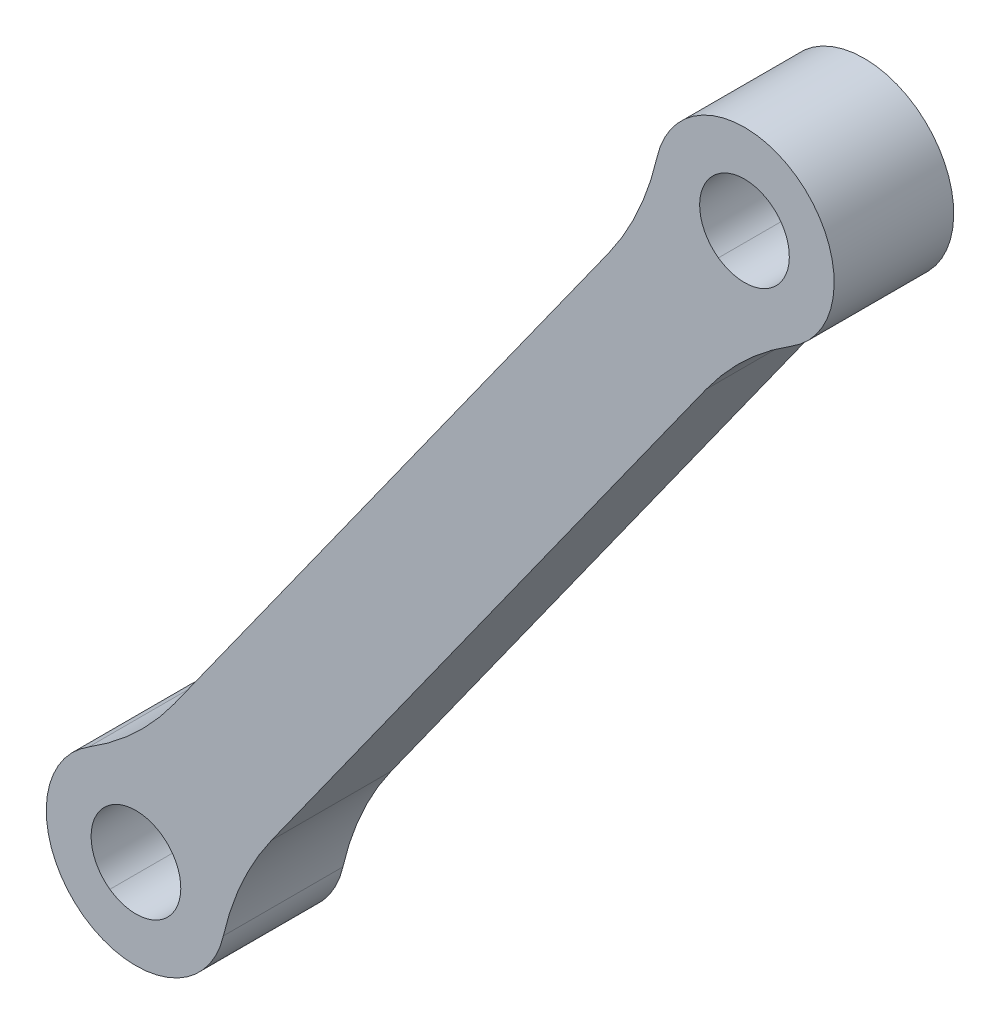
ISO-10303-21;
HEADER;
FILE_DESCRIPTION(('STEP AP214'),'2;1');
FILE_NAME('part.step','',(''),(''),'','','');
FILE_SCHEMA(('AUTOMOTIVE_DESIGN { 1 0 10303 214 1 1 1 1 }'));
ENDSEC;
DATA;
#1=APPLICATION_CONTEXT('core data for automotive mechanical design processes');
#2=APPLICATION_PROTOCOL_DEFINITION('international standard','automotive_design',2000,#1);
#3=PRODUCT_CONTEXT('',#1,'mechanical');
#4=PRODUCT('Part','Part','',(#3));
#5=PRODUCT_RELATED_PRODUCT_CATEGORY('part','',(#4));
#6=PRODUCT_DEFINITION_FORMATION('','',#4);
#7=PRODUCT_DEFINITION_CONTEXT('part definition',#1,'design');
#8=PRODUCT_DEFINITION('design','',#6,#7);
#9=PRODUCT_DEFINITION_SHAPE('','',#8);
#10=(LENGTH_UNIT() NAMED_UNIT(*) SI_UNIT(.MILLI.,.METRE.));
#11=(NAMED_UNIT(*) PLANE_ANGLE_UNIT() SI_UNIT($,.RADIAN.));
#12=(NAMED_UNIT(*) SI_UNIT($,.STERADIAN.) SOLID_ANGLE_UNIT());
#13=UNCERTAINTY_MEASURE_WITH_UNIT(LENGTH_MEASURE(1.E-05),#10,'distance_accuracy_value','');
#14=(GEOMETRIC_REPRESENTATION_CONTEXT(3) GLOBAL_UNCERTAINTY_ASSIGNED_CONTEXT((#13)) GLOBAL_UNIT_ASSIGNED_CONTEXT((#10,
#11,#12)) REPRESENTATION_CONTEXT('',''));
#15=CARTESIAN_POINT('',(0.,0.,0.));
#16=DIRECTION('',(0.,0.,1.));
#17=DIRECTION('',(1.,0.,0.));
#18=AXIS2_PLACEMENT_3D('',#15,#16,#17);
#19=CARTESIAN_POINT('',(18.4192995136628,15.9142297458002,63.));
#20=DIRECTION('',(0.,0.,-1.));
#21=DIRECTION('',(-0.581612189437182,-0.813466201570838,0.));
#22=AXIS2_PLACEMENT_3D('',#19,#20,#21);
#23=CYLINDRICAL_SURFACE('',#22,10.);
#24=CARTESIAN_POINT('',(18.4192995136628,15.9142297458002,63.));
#25=DIRECTION('',(0.,0.,-1.));
#26=DIRECTION('',(0.581612189437181,0.813466201570839,0.));
#27=AXIS2_PLACEMENT_3D('',#24,#25,#26);
#28=CIRCLE('',#27,10.);
#29=CARTESIAN_POINT('',(26.5539615293712,10.0981078514284,63.));
#30=VERTEX_POINT('',#29);
#31=CARTESIAN_POINT('',(23.6912483380199,7.41678568341526,63.));
#32=VERTEX_POINT('',#31);
#33=EDGE_CURVE('E212',#30,#32,#28,.T.);
#34=ORIENTED_EDGE('',*,*,#33,.F.);
#35=DIRECTION('',(0.,0.,1.));
#36=VECTOR('',#35,1.);
#37=CARTESIAN_POINT('',(26.5539615293712,10.0981078514284,63.));
#38=LINE('',#37,#36);
#39=CARTESIAN_POINT('',(26.5539615293712,10.0981078514284,59.));
#40=VERTEX_POINT('',#39);
#41=EDGE_CURVE('E237',#40,#30,#38,.T.);
#42=ORIENTED_EDGE('',*,*,#41,.F.);
#43=CARTESIAN_POINT('',(18.4192995136628,15.9142297458002,59.));
#44=DIRECTION('',(0.,0.,1.));
#45=DIRECTION('',(0.581612189437182,0.813466201570838,0.));
#46=AXIS2_PLACEMENT_3D('',#43,#44,#45);
#47=CIRCLE('',#46,10.);
#48=CARTESIAN_POINT('',(23.6912483380199,7.41678568341526,59.));
#49=VERTEX_POINT('',#48);
#50=EDGE_CURVE('E28',#49,#40,#47,.T.);
#51=ORIENTED_EDGE('',*,*,#50,.F.);
#52=DIRECTION('',(0.,0.,-1.));
#53=VECTOR('',#52,1.);
#54=CARTESIAN_POINT('',(23.6912483380199,7.41678568341526,63.));
#55=LINE('',#54,#53);
#56=EDGE_CURVE('E236',#32,#49,#55,.T.);
#57=ORIENTED_EDGE('',*,*,#56,.F.);
#58=EDGE_LOOP('',(#34,#42,#51,#57));
#59=FACE_BOUND('',#58,.T.);
#60=ADVANCED_FACE('F17',(#59),#23,.F.);
#61=CARTESIAN_POINT('',(37.9424883513629,1.9555371993078,63.));
#62=DIRECTION('',(0.,0.,-1.));
#63=DIRECTION('',(-0.581612189437182,-0.813466201570838,0.));
#64=AXIS2_PLACEMENT_3D('',#61,#62,#63);
#65=CYLINDRICAL_SURFACE('',#64,10.);
#66=CARTESIAN_POINT('',(37.9424883513629,1.9555371993078,63.));
#67=DIRECTION('',(0.,0.,-1.));
#68=DIRECTION('',(0.58161218943718,0.81346620157084,0.));
#69=AXIS2_PLACEMENT_3D('',#66,#67,#68);
#70=CIRCLE('',#69,10.);
#71=CARTESIAN_POINT('',(28.1965996082583,4.19554894191702,63.));
#72=VERTEX_POINT('',#71);
#73=CARTESIAN_POINT('',(29.8078263356546,7.77165909367962,63.));
#74=VERTEX_POINT('',#73);
#75=EDGE_CURVE('E43',#72,#74,#70,.T.);
#76=ORIENTED_EDGE('',*,*,#75,.F.);
#77=DIRECTION('',(0.,0.,1.));
#78=VECTOR('',#77,1.);
#79=CARTESIAN_POINT('',(28.1965996082583,4.19554894191702,63.));
#80=LINE('',#79,#78);
#81=CARTESIAN_POINT('',(28.1965996082583,4.19554894191702,59.));
#82=VERTEX_POINT('',#81);
#83=EDGE_CURVE('E206',#82,#72,#80,.T.);
#84=ORIENTED_EDGE('',*,*,#83,.F.);
#85=CARTESIAN_POINT('',(37.9424883513629,1.9555371993078,59.));
#86=DIRECTION('',(0.,0.,1.));
#87=DIRECTION('',(0.581612189437182,0.813466201570838,0.));
#88=AXIS2_PLACEMENT_3D('',#85,#86,#87);
#89=CIRCLE('',#88,10.);
#90=CARTESIAN_POINT('',(29.8078263356546,7.77165909367962,59.));
#91=VERTEX_POINT('',#90);
#92=EDGE_CURVE('E21',#91,#82,#89,.T.);
#93=ORIENTED_EDGE('',*,*,#92,.F.);
#94=DIRECTION('',(0.,0.,-1.));
#95=VECTOR('',#94,1.);
#96=CARTESIAN_POINT('',(29.8078263356546,7.77165909367962,59.));
#97=LINE('',#96,#95);
#98=EDGE_CURVE('E199',#74,#91,#97,.T.);
#99=ORIENTED_EDGE('',*,*,#98,.F.);
#100=EDGE_LOOP('',(#76,#84,#93,#99));
#101=FACE_BOUND('',#100,.T.);
#102=ADVANCED_FACE('F343',(#101),#65,.F.);
#103=CARTESIAN_POINT('',(32.9596042495924,36.2508847850711,63.));
#104=DIRECTION('',(0.,0.,-1.));
#105=DIRECTION('',(-0.581612189437182,-0.813466201570838,0.));
#106=AXIS2_PLACEMENT_3D('',#103,#104,#105);
#107=CYLINDRICAL_SURFACE('',#106,10.);
#108=CARTESIAN_POINT('',(32.9596042495924,36.2508847850711,63.));
#109=DIRECTION('',(0.,0.,-1.));
#110=DIRECTION('',(0.581612189437182,0.813466201570838,0.));
#111=AXIS2_PLACEMENT_3D('',#108,#109,#110);
#112=CIRCLE('',#111,10.);
#113=CARTESIAN_POINT('',(42.705492992697,34.0108730424619,63.));
#114=VERTEX_POINT('',#113);
#115=CARTESIAN_POINT('',(41.0942662653008,30.4347628906993,63.));
#116=VERTEX_POINT('',#115);
#117=EDGE_CURVE('E176',#114,#116,#112,.T.);
#118=ORIENTED_EDGE('',*,*,#117,.F.);
#119=DIRECTION('',(0.,0.,1.));
#120=VECTOR('',#119,1.);
#121=CARTESIAN_POINT('',(42.705492992697,34.0108730424619,63.));
#122=LINE('',#121,#120);
#123=CARTESIAN_POINT('',(42.705492992697,34.0108730424619,59.));
#124=VERTEX_POINT('',#123);
#125=EDGE_CURVE('E174',#124,#114,#122,.T.);
#126=ORIENTED_EDGE('',*,*,#125,.F.);
#127=CARTESIAN_POINT('',(32.9596042495924,36.2508847850711,59.));
#128=DIRECTION('',(0.,0.,1.));
#129=DIRECTION('',(0.581612189437182,0.813466201570838,0.));
#130=AXIS2_PLACEMENT_3D('',#127,#128,#129);
#131=CIRCLE('',#130,10.);
#132=CARTESIAN_POINT('',(41.0942662653008,30.4347628906993,59.));
#133=VERTEX_POINT('',#132);
#134=EDGE_CURVE('E11',#133,#124,#131,.T.);
#135=ORIENTED_EDGE('',*,*,#134,.F.);
#136=DIRECTION('',(0.,0.,-1.));
#137=VECTOR('',#136,1.);
#138=CARTESIAN_POINT('',(41.0942662653008,30.4347628906993,63.));
#139=LINE('',#138,#137);
#140=EDGE_CURVE('E227',#116,#133,#139,.T.);
#141=ORIENTED_EDGE('',*,*,#140,.F.);
#142=EDGE_LOOP('',(#118,#126,#135,#141));
#143=FACE_BOUND('',#142,.T.);
#144=ADVANCED_FACE('F175',(#143),#107,.F.);
#145=CARTESIAN_POINT('',(52.4827930872925,22.2921922385787,63.));
#146=DIRECTION('',(0.,0.,-1.));
#147=DIRECTION('',(-0.581612189437182,-0.813466201570838,0.));
#148=AXIS2_PLACEMENT_3D('',#145,#146,#147);
#149=CYLINDRICAL_SURFACE('',#148,10.);
#150=CARTESIAN_POINT('',(52.4827930872925,22.2921922385787,63.));
#151=DIRECTION('',(0.,0.,-1.));
#152=DIRECTION('',(0.581612189437178,0.813466201570841,0.));
#153=AXIS2_PLACEMENT_3D('',#150,#151,#152);
#154=CIRCLE('',#153,10.);
#155=CARTESIAN_POINT('',(44.3481310715841,28.1083141329506,63.));
#156=VERTEX_POINT('',#155);
#157=CARTESIAN_POINT('',(47.2108442629354,30.7896363009637,63.));
#158=VERTEX_POINT('',#157);
#159=EDGE_CURVE('E217',#156,#158,#154,.T.);
#160=ORIENTED_EDGE('',*,*,#159,.F.);
#161=DIRECTION('',(0.,0.,1.));
#162=VECTOR('',#161,1.);
#163=CARTESIAN_POINT('',(44.3481310715841,28.1083141329506,63.));
#164=LINE('',#163,#162);
#165=CARTESIAN_POINT('',(44.3481310715841,28.1083141329506,59.));
#166=VERTEX_POINT('',#165);
#167=EDGE_CURVE('E200',#166,#156,#164,.T.);
#168=ORIENTED_EDGE('',*,*,#167,.F.);
#169=CARTESIAN_POINT('',(52.4827930872925,22.2921922385787,59.));
#170=DIRECTION('',(0.,0.,1.));
#171=DIRECTION('',(0.581612189437182,0.813466201570838,0.));
#172=AXIS2_PLACEMENT_3D('',#169,#170,#171);
#173=CIRCLE('',#172,10.);
#174=CARTESIAN_POINT('',(47.2108442629354,30.7896363009637,59.));
#175=VERTEX_POINT('',#174);
#176=EDGE_CURVE('E299',#175,#166,#173,.T.);
#177=ORIENTED_EDGE('',*,*,#176,.F.);
#178=DIRECTION('',(0.,0.,-1.));
#179=VECTOR('',#178,1.);
#180=CARTESIAN_POINT('',(47.2108442629354,30.7896363009637,63.));
#181=LINE('',#180,#179);
#182=EDGE_CURVE('E184',#158,#175,#181,.T.);
#183=ORIENTED_EDGE('',*,*,#182,.F.);
#184=EDGE_LOOP('',(#160,#168,#177,#183));
#185=FACE_BOUND('',#184,.T.);
#186=ADVANCED_FACE('F19',(#185),#149,.F.);
#187=CARTESIAN_POINT('',(43.808932991039,30.792887485919,59.));
#188=DIRECTION('',(0.,0.,1.));
#189=DIRECTION('',(0.581612189437182,0.813466201570838,0.));
#190=AXIS2_PLACEMENT_3D('',#187,#188,#189);
#191=PLANE('',#190);
#192=CARTESIAN_POINT('',(45.6292596156283,33.3388695196791,59.));
#193=DIRECTION('',(0.,0.,1.));
#194=DIRECTION('',(0.581612189437182,0.813466201570838,0.));
#195=AXIS2_PLACEMENT_3D('',#192,#193,#194);
#196=CIRCLE('',#195,1.5);
#197=CARTESIAN_POINT('',(44.7568413314726,32.1186702173229,59.));
#198=VERTEX_POINT('',#197);
#199=CARTESIAN_POINT('',(46.5016778997841,34.5590688220354,59.));
#200=VERTEX_POINT('',#199);
#201=EDGE_CURVE('E266',#198,#200,#196,.T.);
#202=ORIENTED_EDGE('',*,*,#201,.T.);
#203=CARTESIAN_POINT('',(45.6292596156283,33.3388695196791,59.));
#204=DIRECTION('',(0.,0.,1.));
#205=DIRECTION('',(0.581612189437182,0.813466201570838,0.));
#206=AXIS2_PLACEMENT_3D('',#203,#204,#205);
#207=CIRCLE('',#206,1.5);
#208=EDGE_CURVE('E94',#200,#198,#207,.T.);
#209=ORIENTED_EDGE('',*,*,#208,.T.);
#210=EDGE_LOOP('',(#202,#209));
#211=FACE_BOUND('',#210,.T.);
#212=CARTESIAN_POINT('',(25.272832985327,4.8675524646998,59.));
#213=DIRECTION('',(0.,0.,1.));
#214=DIRECTION('',(0.581612189437182,0.813466201570838,0.));
#215=AXIS2_PLACEMENT_3D('',#212,#213,#214);
#216=CIRCLE('',#215,1.5);
#217=CARTESIAN_POINT('',(24.4004147011712,3.64735316234354,59.));
#218=VERTEX_POINT('',#217);
#219=CARTESIAN_POINT('',(26.1452512694827,6.08775176705605,59.));
#220=VERTEX_POINT('',#219);
#221=EDGE_CURVE('E225',#218,#220,#216,.T.);
#222=ORIENTED_EDGE('',*,*,#221,.T.);
#223=CARTESIAN_POINT('',(25.272832985327,4.8675524646998,59.));
#224=DIRECTION('',(0.,0.,1.));
#225=DIRECTION('',(0.581612189437182,0.813466201570838,0.));
#226=AXIS2_PLACEMENT_3D('',#223,#224,#225);
#227=CIRCLE('',#226,1.5);
#228=EDGE_CURVE('E208',#220,#218,#227,.T.);
#229=ORIENTED_EDGE('',*,*,#228,.T.);
#230=EDGE_LOOP('',(#222,#229));
#231=FACE_BOUND('',#230,.T.);
#232=CARTESIAN_POINT('',(45.6292596156283,33.3388695196791,59.));
#233=DIRECTION('',(0.,0.,1.));
#234=DIRECTION('',(0.581612189437182,0.813466201570838,0.));
#235=AXIS2_PLACEMENT_3D('',#232,#233,#234);
#236=CIRCLE('',#235,3.);
#237=EDGE_CURVE('E166',#175,#124,#236,.T.);
#238=ORIENTED_EDGE('',*,*,#237,.F.);
#239=ORIENTED_EDGE('',*,*,#176,.T.);
#240=DIRECTION('',(0.581612189437182,0.813466201570838,0.));
#241=VECTOR('',#240,1.);
#242=CARTESIAN_POINT('',(45.4358653941807,29.6296631070446,59.));
#243=LINE('',#242,#241);
#244=EDGE_CURVE('E196',#91,#166,#243,.T.);
#245=ORIENTED_EDGE('',*,*,#244,.F.);
#246=ORIENTED_EDGE('',*,*,#92,.T.);
#247=CARTESIAN_POINT('',(25.272832985327,4.8675524646998,59.));
#248=DIRECTION('',(0.,0.,1.));
#249=DIRECTION('',(0.581612189437182,0.813466201570838,0.));
#250=AXIS2_PLACEMENT_3D('',#247,#248,#249);
#251=CIRCLE('',#250,3.);
#252=CARTESIAN_POINT('',(23.5279964170154,2.42715385998728,59.));
#253=VERTEX_POINT('',#252);
#254=EDGE_CURVE('E202',#253,#82,#251,.T.);
#255=ORIENTED_EDGE('',*,*,#254,.F.);
#256=CARTESIAN_POINT('',(25.272832985327,4.8675524646998,59.));
#257=DIRECTION('',(0.,0.,1.));
#258=DIRECTION('',(0.581612189437182,0.813466201570838,0.));
#259=AXIS2_PLACEMENT_3D('',#256,#257,#258);
#260=CIRCLE('',#259,3.);
#261=EDGE_CURVE('E144',#49,#253,#260,.T.);
#262=ORIENTED_EDGE('',*,*,#261,.F.);
#263=ORIENTED_EDGE('',*,*,#50,.T.);
#264=DIRECTION('',(0.581612189437182,0.813466201570838,0.));
#265=VECTOR('',#264,1.);
#266=CARTESIAN_POINT('',(42.1820005878973,31.9561118647934,59.));
#267=LINE('',#266,#265);
#268=EDGE_CURVE('E169',#40,#133,#267,.T.);
#269=ORIENTED_EDGE('',*,*,#268,.T.);
#270=ORIENTED_EDGE('',*,*,#134,.T.);
#271=EDGE_LOOP('',(#238,#239,#245,#246,#255,#262,#263,#269,#270));
#272=FACE_BOUND('',#271,.T.);
#273=ADVANCED_FACE('F164',(#211,#231,#272),#191,.F.);
#274=CARTESIAN_POINT('',(43.808932991039,30.792887485919,63.));
#275=DIRECTION('',(0.,0.,1.));
#276=DIRECTION('',(0.581612189437182,0.813466201570838,0.));
#277=AXIS2_PLACEMENT_3D('',#274,#275,#276);
#278=PLANE('',#277);
#279=CARTESIAN_POINT('',(45.6292596156283,33.3388695196791,63.));
#280=DIRECTION('',(0.,0.,1.));
#281=DIRECTION('',(0.581612189437182,0.813466201570838,0.));
#282=AXIS2_PLACEMENT_3D('',#279,#280,#281);
#283=CIRCLE('',#282,1.5);
#284=CARTESIAN_POINT('',(44.7568413314726,32.1186702173229,63.));
#285=VERTEX_POINT('',#284);
#286=CARTESIAN_POINT('',(46.5016778997841,34.5590688220354,63.));
#287=VERTEX_POINT('',#286);
#288=EDGE_CURVE('E260',#285,#287,#283,.T.);
#289=ORIENTED_EDGE('',*,*,#288,.F.);
#290=CARTESIAN_POINT('',(45.6292596156283,33.3388695196791,63.));
#291=DIRECTION('',(0.,0.,1.));
#292=DIRECTION('',(0.581612189437182,0.813466201570838,0.));
#293=AXIS2_PLACEMENT_3D('',#290,#291,#292);
#294=CIRCLE('',#293,1.5);
#295=EDGE_CURVE('E286',#287,#285,#294,.T.);
#296=ORIENTED_EDGE('',*,*,#295,.F.);
#297=EDGE_LOOP('',(#289,#296));
#298=FACE_BOUND('',#297,.T.);
#299=CARTESIAN_POINT('',(25.272832985327,4.8675524646998,63.));
#300=DIRECTION('',(0.,0.,1.));
#301=DIRECTION('',(0.581612189437182,0.813466201570838,0.));
#302=AXIS2_PLACEMENT_3D('',#299,#300,#301);
#303=CIRCLE('',#302,1.5);
#304=CARTESIAN_POINT('',(24.4004147011712,3.64735316234354,63.));
#305=VERTEX_POINT('',#304);
#306=CARTESIAN_POINT('',(26.1452512694827,6.08775176705605,63.));
#307=VERTEX_POINT('',#306);
#308=EDGE_CURVE('E226',#305,#307,#303,.T.);
#309=ORIENTED_EDGE('',*,*,#308,.F.);
#310=CARTESIAN_POINT('',(25.272832985327,4.8675524646998,63.));
#311=DIRECTION('',(0.,0.,1.));
#312=DIRECTION('',(0.581612189437182,0.813466201570838,0.));
#313=AXIS2_PLACEMENT_3D('',#310,#311,#312);
#314=CIRCLE('',#313,1.5);
#315=EDGE_CURVE('E211',#307,#305,#314,.T.);
#316=ORIENTED_EDGE('',*,*,#315,.F.);
#317=EDGE_LOOP('',(#309,#316));
#318=FACE_BOUND('',#317,.T.);
#319=DIRECTION('',(0.581612189437182,0.813466201570838,0.));
#320=VECTOR('',#319,1.);
#321=CARTESIAN_POINT('',(45.4358653941807,29.6296631070446,63.));
#322=LINE('',#321,#320);
#323=EDGE_CURVE('E198',#74,#156,#322,.T.);
#324=ORIENTED_EDGE('',*,*,#323,.T.);
#325=ORIENTED_EDGE('',*,*,#159,.T.);
#326=CARTESIAN_POINT('',(45.6292596156283,33.3388695196791,63.));
#327=DIRECTION('',(0.,0.,1.));
#328=DIRECTION('',(0.581612189437182,0.813466201570838,0.));
#329=AXIS2_PLACEMENT_3D('',#326,#327,#328);
#330=CIRCLE('',#329,3.);
#331=EDGE_CURVE('E192',#158,#114,#330,.T.);
#332=ORIENTED_EDGE('',*,*,#331,.T.);
#333=ORIENTED_EDGE('',*,*,#117,.T.);
#334=DIRECTION('',(0.581612189437182,0.813466201570838,0.));
#335=VECTOR('',#334,1.);
#336=CARTESIAN_POINT('',(42.1820005878973,31.9561118647934,63.));
#337=LINE('',#336,#335);
#338=EDGE_CURVE('E181',#30,#116,#337,.T.);
#339=ORIENTED_EDGE('',*,*,#338,.F.);
#340=ORIENTED_EDGE('',*,*,#33,.T.);
#341=CARTESIAN_POINT('',(25.272832985327,4.8675524646998,63.));
#342=DIRECTION('',(0.,0.,1.));
#343=DIRECTION('',(0.581612189437182,0.813466201570838,0.));
#344=AXIS2_PLACEMENT_3D('',#341,#342,#343);
#345=CIRCLE('',#344,3.);
#346=CARTESIAN_POINT('',(23.5279964170154,2.42715385998728,63.));
#347=VERTEX_POINT('',#346);
#348=EDGE_CURVE('E105',#32,#347,#345,.T.);
#349=ORIENTED_EDGE('',*,*,#348,.T.);
#350=CARTESIAN_POINT('',(25.272832985327,4.8675524646998,63.));
#351=DIRECTION('',(0.,0.,1.));
#352=DIRECTION('',(0.581612189437182,0.813466201570838,0.));
#353=AXIS2_PLACEMENT_3D('',#350,#351,#352);
#354=CIRCLE('',#353,3.);
#355=EDGE_CURVE('E233',#347,#72,#354,.T.);
#356=ORIENTED_EDGE('',*,*,#355,.T.);
#357=ORIENTED_EDGE('',*,*,#75,.T.);
#358=EDGE_LOOP('',(#324,#325,#332,#333,#339,#340,#349,#356,#357));
#359=FACE_BOUND('',#358,.T.);
#360=ADVANCED_FACE('F247',(#298,#318,#359),#278,.T.);
#361=CARTESIAN_POINT('',(45.4358653941807,29.6296631070446,63.));
#362=DIRECTION('',(-0.813466201570838,0.581612189437182,0.));
#363=DIRECTION('',(0.581612189437182,0.813466201570838,0.));
#364=AXIS2_PLACEMENT_3D('',#361,#362,#363);
#365=PLANE('',#364);
#366=ORIENTED_EDGE('',*,*,#244,.T.);
#367=ORIENTED_EDGE('',*,*,#167,.T.);
#368=ORIENTED_EDGE('',*,*,#323,.F.);
#369=ORIENTED_EDGE('',*,*,#98,.T.);
#370=EDGE_LOOP('',(#366,#367,#368,#369));
#371=FACE_BOUND('',#370,.T.);
#372=ADVANCED_FACE('F323',(#371),#365,.F.);
#373=CARTESIAN_POINT('',(25.272832985327,4.8675524646998,63.));
#374=DIRECTION('',(0.,0.,-1.));
#375=DIRECTION('',(-0.581612189437182,-0.813466201570838,0.));
#376=AXIS2_PLACEMENT_3D('',#373,#374,#375);
#377=CYLINDRICAL_SURFACE('',#376,1.5);
#378=DIRECTION('',(0.,0.,-1.));
#379=VECTOR('',#378,1.);
#380=CARTESIAN_POINT('',(26.1452512694827,6.08775176705605,63.));
#381=LINE('',#380,#379);
#382=EDGE_CURVE('E221',#307,#220,#381,.T.);
#383=ORIENTED_EDGE('',*,*,#382,.F.);
#384=ORIENTED_EDGE('',*,*,#315,.T.);
#385=DIRECTION('',(0.,0.,-1.));
#386=VECTOR('',#385,1.);
#387=CARTESIAN_POINT('',(24.4004147011712,3.64735316234354,63.));
#388=LINE('',#387,#386);
#389=EDGE_CURVE('E263',#305,#218,#388,.T.);
#390=ORIENTED_EDGE('',*,*,#389,.T.);
#391=ORIENTED_EDGE('',*,*,#228,.F.);
#392=EDGE_LOOP('',(#383,#384,#390,#391));
#393=FACE_BOUND('',#392,.T.);
#394=ADVANCED_FACE('F332',(#393),#377,.F.);
#395=CARTESIAN_POINT('',(45.6292596156283,33.3388695196791,63.));
#396=DIRECTION('',(0.,0.,-1.));
#397=DIRECTION('',(-0.581612189437182,-0.813466201570838,0.));
#398=AXIS2_PLACEMENT_3D('',#395,#396,#397);
#399=CYLINDRICAL_SURFACE('',#398,1.5);
#400=DIRECTION('',(0.,0.,-1.));
#401=VECTOR('',#400,1.);
#402=CARTESIAN_POINT('',(46.5016778997841,34.5590688220354,63.));
#403=LINE('',#402,#401);
#404=EDGE_CURVE('E262',#287,#200,#403,.T.);
#405=ORIENTED_EDGE('',*,*,#404,.F.);
#406=ORIENTED_EDGE('',*,*,#295,.T.);
#407=DIRECTION('',(0.,0.,-1.));
#408=VECTOR('',#407,1.);
#409=CARTESIAN_POINT('',(44.7568413314726,32.1186702173229,63.));
#410=LINE('',#409,#408);
#411=EDGE_CURVE('E273',#285,#198,#410,.T.);
#412=ORIENTED_EDGE('',*,*,#411,.T.);
#413=ORIENTED_EDGE('',*,*,#208,.F.);
#414=EDGE_LOOP('',(#405,#406,#412,#413));
#415=FACE_BOUND('',#414,.T.);
#416=ADVANCED_FACE('F317',(#415),#399,.F.);
#417=CARTESIAN_POINT('',(25.272832985327,4.8675524646998,63.));
#418=DIRECTION('',(0.,0.,-1.));
#419=DIRECTION('',(-0.581612189437182,-0.813466201570838,0.));
#420=AXIS2_PLACEMENT_3D('',#417,#418,#419);
#421=CYLINDRICAL_SURFACE('',#420,3.);
#422=DIRECTION('',(0.,0.,-1.));
#423=VECTOR('',#422,1.);
#424=CARTESIAN_POINT('',(23.5279964170154,2.42715385998728,63.));
#425=LINE('',#424,#423);
#426=EDGE_CURVE('E207',#347,#253,#425,.T.);
#427=ORIENTED_EDGE('',*,*,#426,.F.);
#428=ORIENTED_EDGE('',*,*,#348,.F.);
#429=ORIENTED_EDGE('',*,*,#56,.T.);
#430=ORIENTED_EDGE('',*,*,#261,.T.);
#431=EDGE_LOOP('',(#427,#428,#429,#430));
#432=FACE_BOUND('',#431,.T.);
#433=ADVANCED_FACE('F353',(#432),#421,.T.);
#434=CARTESIAN_POINT('',(42.1820005878973,31.9561118647934,63.));
#435=DIRECTION('',(-0.813466201570838,0.581612189437182,0.));
#436=DIRECTION('',(0.581612189437182,0.813466201570838,0.));
#437=AXIS2_PLACEMENT_3D('',#434,#435,#436);
#438=PLANE('',#437);
#439=ORIENTED_EDGE('',*,*,#338,.T.);
#440=ORIENTED_EDGE('',*,*,#140,.T.);
#441=ORIENTED_EDGE('',*,*,#268,.F.);
#442=ORIENTED_EDGE('',*,*,#41,.T.);
#443=EDGE_LOOP('',(#439,#440,#441,#442));
#444=FACE_BOUND('',#443,.T.);
#445=ADVANCED_FACE('F245',(#444),#438,.T.);
#446=CARTESIAN_POINT('',(45.6292596156283,33.3388695196791,63.));
#447=DIRECTION('',(0.,0.,-1.));
#448=DIRECTION('',(-0.581612189437182,-0.813466201570838,0.));
#449=AXIS2_PLACEMENT_3D('',#446,#447,#448);
#450=CYLINDRICAL_SURFACE('',#449,3.);
#451=ORIENTED_EDGE('',*,*,#331,.F.);
#452=ORIENTED_EDGE('',*,*,#182,.T.);
#453=ORIENTED_EDGE('',*,*,#237,.T.);
#454=ORIENTED_EDGE('',*,*,#125,.T.);
#455=EDGE_LOOP('',(#451,#452,#453,#454));
#456=FACE_BOUND('',#455,.T.);
#457=ADVANCED_FACE('F182',(#456),#450,.T.);
#458=CARTESIAN_POINT('',(25.272832985327,4.8675524646998,63.));
#459=DIRECTION('',(0.,0.,-1.));
#460=DIRECTION('',(-0.581612189437182,-0.813466201570838,0.));
#461=AXIS2_PLACEMENT_3D('',#458,#459,#460);
#462=CYLINDRICAL_SURFACE('',#461,3.);
#463=ORIENTED_EDGE('',*,*,#355,.F.);
#464=ORIENTED_EDGE('',*,*,#426,.T.);
#465=ORIENTED_EDGE('',*,*,#254,.T.);
#466=ORIENTED_EDGE('',*,*,#83,.T.);
#467=EDGE_LOOP('',(#463,#464,#465,#466));
#468=FACE_BOUND('',#467,.T.);
#469=ADVANCED_FACE('F358',(#468),#462,.T.);
#470=CARTESIAN_POINT('',(45.6292596156283,33.3388695196791,63.));
#471=DIRECTION('',(0.,0.,-1.));
#472=DIRECTION('',(-0.581612189437182,-0.813466201570838,0.));
#473=AXIS2_PLACEMENT_3D('',#470,#471,#472);
#474=CYLINDRICAL_SURFACE('',#473,1.5);
#475=ORIENTED_EDGE('',*,*,#288,.T.);
#476=ORIENTED_EDGE('',*,*,#404,.T.);
#477=ORIENTED_EDGE('',*,*,#201,.F.);
#478=ORIENTED_EDGE('',*,*,#411,.F.);
#479=EDGE_LOOP('',(#475,#476,#477,#478));
#480=FACE_BOUND('',#479,.T.);
#481=ADVANCED_FACE('F320',(#480),#474,.F.);
#482=CARTESIAN_POINT('',(25.272832985327,4.8675524646998,63.));
#483=DIRECTION('',(0.,0.,-1.));
#484=DIRECTION('',(-0.581612189437182,-0.813466201570838,0.));
#485=AXIS2_PLACEMENT_3D('',#482,#483,#484);
#486=CYLINDRICAL_SURFACE('',#485,1.5);
#487=ORIENTED_EDGE('',*,*,#308,.T.);
#488=ORIENTED_EDGE('',*,*,#382,.T.);
#489=ORIENTED_EDGE('',*,*,#221,.F.);
#490=ORIENTED_EDGE('',*,*,#389,.F.);
#491=EDGE_LOOP('',(#487,#488,#489,#490));
#492=FACE_BOUND('',#491,.T.);
#493=ADVANCED_FACE('F329',(#492),#486,.F.);
#494=CLOSED_SHELL('',(#60,#102,#144,#186,#273,#360,#372,#394,#416,#433,#445,#457,#469,#481,#493));
#495=MANIFOLD_SOLID_BREP('B1',#494);
#496=ADVANCED_BREP_SHAPE_REPRESENTATION('',(#18,#495),#14);
#497=SHAPE_DEFINITION_REPRESENTATION(#9,#496);
ENDSEC;
END-ISO-10303-21;
